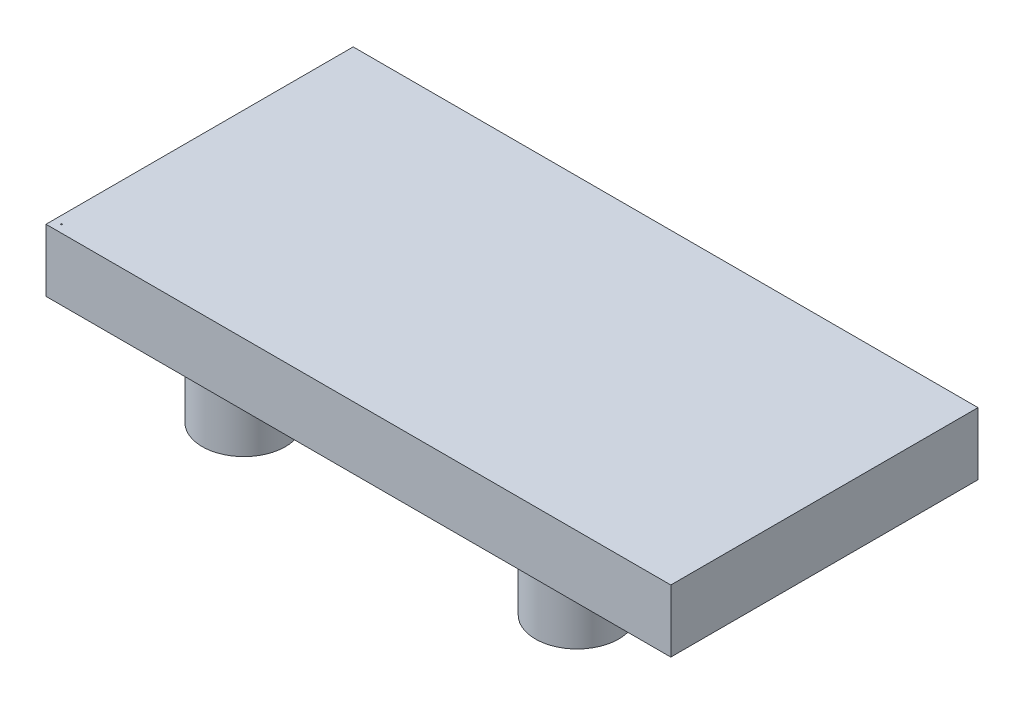
ISO-10303-21;
HEADER;
FILE_DESCRIPTION(('STEP AP214'),'2;1');
FILE_NAME('part.step','',(''),(''),'','','');
FILE_SCHEMA(('AUTOMOTIVE_DESIGN { 1 0 10303 214 1 1 1 1 }'));
ENDSEC;
DATA;
#1=APPLICATION_CONTEXT('core data for automotive mechanical design processes');
#2=APPLICATION_PROTOCOL_DEFINITION('international standard','automotive_design',2000,#1);
#3=PRODUCT_CONTEXT('',#1,'mechanical');
#4=PRODUCT('Part','Part','',(#3));
#5=PRODUCT_RELATED_PRODUCT_CATEGORY('part','',(#4));
#6=PRODUCT_DEFINITION_FORMATION('','',#4);
#7=PRODUCT_DEFINITION_CONTEXT('part definition',#1,'design');
#8=PRODUCT_DEFINITION('design','',#6,#7);
#9=PRODUCT_DEFINITION_SHAPE('','',#8);
#10=(LENGTH_UNIT() NAMED_UNIT(*) SI_UNIT(.MILLI.,.METRE.));
#11=(NAMED_UNIT(*) PLANE_ANGLE_UNIT() SI_UNIT($,.RADIAN.));
#12=(NAMED_UNIT(*) SI_UNIT($,.STERADIAN.) SOLID_ANGLE_UNIT());
#13=UNCERTAINTY_MEASURE_WITH_UNIT(LENGTH_MEASURE(1.E-05),#10,'distance_accuracy_value','');
#14=(GEOMETRIC_REPRESENTATION_CONTEXT(3) GLOBAL_UNCERTAINTY_ASSIGNED_CONTEXT((#13)) GLOBAL_UNIT_ASSIGNED_CONTEXT((#10,
#11,#12)) REPRESENTATION_CONTEXT('',''));
#15=CARTESIAN_POINT('',(0.,0.,0.));
#16=DIRECTION('',(0.,0.,1.));
#17=DIRECTION('',(1.,0.,0.));
#18=AXIS2_PLACEMENT_3D('',#15,#16,#17);
#19=CARTESIAN_POINT('',(0.,-304.8,-1498.6));
#20=DIRECTION('',(0.,-1.,0.));
#21=DIRECTION('',(0.,0.,-1.));
#22=AXIS2_PLACEMENT_3D('',#19,#20,#21);
#23=PLANE('',#22);
#24=CARTESIAN_POINT('',(711.2,-304.8,-1270.));
#25=DIRECTION('',(0.,-1.,0.));
#26=DIRECTION('',(0.,0.,-1.));
#27=AXIS2_PLACEMENT_3D('',#24,#25,#26);
#28=CIRCLE('',#27,203.2);
#29=CARTESIAN_POINT('',(711.2,-304.8,-1473.2));
#30=VERTEX_POINT('',#29);
#31=EDGE_CURVE('E151',#30,#30,#28,.T.);
#32=ORIENTED_EDGE('',*,*,#31,.F.);
#33=EDGE_LOOP('',(#32));
#34=FACE_BOUND('',#33,.T.);
#35=CARTESIAN_POINT('',(711.2,-304.8,-254.));
#36=DIRECTION('',(0.,-1.,0.));
#37=DIRECTION('',(0.,0.,-1.));
#38=AXIS2_PLACEMENT_3D('',#35,#36,#37);
#39=CIRCLE('',#38,203.2);
#40=CARTESIAN_POINT('',(711.2,-304.8,-457.2));
#41=VERTEX_POINT('',#40);
#42=EDGE_CURVE('E163',#41,#41,#39,.T.);
#43=ORIENTED_EDGE('',*,*,#42,.F.);
#44=EDGE_LOOP('',(#43));
#45=FACE_BOUND('',#44,.T.);
#46=DIRECTION('',(0.,0.,1.));
#47=VECTOR('',#46,1.);
#48=CARTESIAN_POINT('',(0.,-304.8,0.));
#49=LINE('',#48,#47);
#50=CARTESIAN_POINT('',(0.,-304.8,-1498.6));
#51=VERTEX_POINT('',#50);
#52=CARTESIAN_POINT('',(0.,-304.8,0.));
#53=VERTEX_POINT('',#52);
#54=EDGE_CURVE('E93',#51,#53,#49,.T.);
#55=ORIENTED_EDGE('',*,*,#54,.F.);
#56=DIRECTION('',(-1.,0.,0.));
#57=VECTOR('',#56,1.);
#58=CARTESIAN_POINT('',(0.,-304.8,-1498.6));
#59=LINE('',#58,#57);
#60=CARTESIAN_POINT('',(3048.,-304.8,-1498.6));
#61=VERTEX_POINT('',#60);
#62=EDGE_CURVE('E90',#61,#51,#59,.T.);
#63=ORIENTED_EDGE('',*,*,#62,.F.);
#64=DIRECTION('',(0.,0.,-1.));
#65=VECTOR('',#64,1.);
#66=CARTESIAN_POINT('',(3048.,-304.8,0.));
#67=LINE('',#66,#65);
#68=CARTESIAN_POINT('',(3048.,-304.8,0.));
#69=VERTEX_POINT('',#68);
#70=EDGE_CURVE('E83',#69,#61,#67,.T.);
#71=ORIENTED_EDGE('',*,*,#70,.F.);
#72=DIRECTION('',(1.,0.,0.));
#73=VECTOR('',#72,1.);
#74=CARTESIAN_POINT('',(0.,-304.8,0.));
#75=LINE('',#74,#73);
#76=EDGE_CURVE('E89',#53,#69,#75,.T.);
#77=ORIENTED_EDGE('',*,*,#76,.F.);
#78=EDGE_LOOP('',(#55,#63,#71,#77));
#79=FACE_BOUND('',#78,.T.);
#80=CARTESIAN_POINT('',(2336.8,-304.8,-254.));
#81=DIRECTION('',(0.,-1.,0.));
#82=DIRECTION('',(0.,0.,-1.));
#83=AXIS2_PLACEMENT_3D('',#80,#81,#82);
#84=CIRCLE('',#83,203.2);
#85=CARTESIAN_POINT('',(2336.8,-304.8,-457.2));
#86=VERTEX_POINT('',#85);
#87=EDGE_CURVE('E157',#86,#86,#84,.T.);
#88=ORIENTED_EDGE('',*,*,#87,.F.);
#89=EDGE_LOOP('',(#88));
#90=FACE_BOUND('',#89,.T.);
#91=CARTESIAN_POINT('',(2336.8,-304.8,-1270.));
#92=DIRECTION('',(0.,-1.,0.));
#93=DIRECTION('',(0.,0.,-1.));
#94=AXIS2_PLACEMENT_3D('',#91,#92,#93);
#95=CIRCLE('',#94,203.2);
#96=CARTESIAN_POINT('',(2336.8,-304.8,-1473.2));
#97=VERTEX_POINT('',#96);
#98=EDGE_CURVE('E145',#97,#97,#95,.T.);
#99=ORIENTED_EDGE('',*,*,#98,.F.);
#100=EDGE_LOOP('',(#99));
#101=FACE_BOUND('',#100,.T.);
#102=ADVANCED_FACE('F34',(#34,#45,#79,#90,#101),#23,.T.);
#103=CARTESIAN_POINT('',(0.,-304.8,0.));
#104=DIRECTION('',(-1.,0.,0.));
#105=DIRECTION('',(0.,0.,1.));
#106=AXIS2_PLACEMENT_3D('',#103,#104,#105);
#107=PLANE('',#106);
#108=DIRECTION('',(0.,0.,1.));
#109=VECTOR('',#108,1.);
#110=CARTESIAN_POINT('',(0.,0.,0.));
#111=LINE('',#110,#109);
#112=CARTESIAN_POINT('',(0.,0.,-1498.6));
#113=VERTEX_POINT('',#112);
#114=CARTESIAN_POINT('',(0.,0.,0.));
#115=VERTEX_POINT('',#114);
#116=EDGE_CURVE('E100',#113,#115,#111,.T.);
#117=ORIENTED_EDGE('',*,*,#116,.F.);
#118=DIRECTION('',(0.,1.,0.));
#119=VECTOR('',#118,1.);
#120=CARTESIAN_POINT('',(0.,-304.8,-1498.6));
#121=LINE('',#120,#119);
#122=EDGE_CURVE('E11',#51,#113,#121,.T.);
#123=ORIENTED_EDGE('',*,*,#122,.F.);
#124=ORIENTED_EDGE('',*,*,#54,.T.);
#125=DIRECTION('',(0.,1.,0.));
#126=VECTOR('',#125,1.);
#127=CARTESIAN_POINT('',(0.,-304.8,0.));
#128=LINE('',#127,#126);
#129=EDGE_CURVE('E38',#53,#115,#128,.T.);
#130=ORIENTED_EDGE('',*,*,#129,.T.);
#131=EDGE_LOOP('',(#117,#123,#124,#130));
#132=FACE_BOUND('',#131,.T.);
#133=ADVANCED_FACE('F36',(#132),#107,.T.);
#134=CARTESIAN_POINT('',(0.,-304.8,-1498.6));
#135=DIRECTION('',(0.,0.,-1.));
#136=DIRECTION('',(-1.,0.,0.));
#137=AXIS2_PLACEMENT_3D('',#134,#135,#136);
#138=PLANE('',#137);
#139=DIRECTION('',(-1.,0.,0.));
#140=VECTOR('',#139,1.);
#141=CARTESIAN_POINT('',(0.,0.,-1498.6));
#142=LINE('',#141,#140);
#143=CARTESIAN_POINT('',(3048.,0.,-1498.6));
#144=VERTEX_POINT('',#143);
#145=EDGE_CURVE('E95',#144,#113,#142,.T.);
#146=ORIENTED_EDGE('',*,*,#145,.F.);
#147=DIRECTION('',(0.,1.,0.));
#148=VECTOR('',#147,1.);
#149=CARTESIAN_POINT('',(3048.,-304.8,-1498.6));
#150=LINE('',#149,#148);
#151=EDGE_CURVE('E44',#61,#144,#150,.T.);
#152=ORIENTED_EDGE('',*,*,#151,.F.);
#153=ORIENTED_EDGE('',*,*,#62,.T.);
#154=ORIENTED_EDGE('',*,*,#122,.T.);
#155=EDGE_LOOP('',(#146,#152,#153,#154));
#156=FACE_BOUND('',#155,.T.);
#157=ADVANCED_FACE('F111',(#156),#138,.T.);
#158=CARTESIAN_POINT('',(3048.,-304.8,0.));
#159=DIRECTION('',(1.,0.,0.));
#160=DIRECTION('',(0.,0.,-1.));
#161=AXIS2_PLACEMENT_3D('',#158,#159,#160);
#162=PLANE('',#161);
#163=DIRECTION('',(0.,0.,-1.));
#164=VECTOR('',#163,1.);
#165=CARTESIAN_POINT('',(3048.,0.,0.));
#166=LINE('',#165,#164);
#167=CARTESIAN_POINT('',(3048.,0.,0.));
#168=VERTEX_POINT('',#167);
#169=EDGE_CURVE('E85',#168,#144,#166,.T.);
#170=ORIENTED_EDGE('',*,*,#169,.F.);
#171=DIRECTION('',(0.,1.,0.));
#172=VECTOR('',#171,1.);
#173=CARTESIAN_POINT('',(3048.,-304.8,0.));
#174=LINE('',#173,#172);
#175=EDGE_CURVE('E80',#69,#168,#174,.T.);
#176=ORIENTED_EDGE('',*,*,#175,.F.);
#177=ORIENTED_EDGE('',*,*,#70,.T.);
#178=ORIENTED_EDGE('',*,*,#151,.T.);
#179=EDGE_LOOP('',(#170,#176,#177,#178));
#180=FACE_BOUND('',#179,.T.);
#181=ADVANCED_FACE('F82',(#180),#162,.T.);
#182=CARTESIAN_POINT('',(0.,-304.8,0.));
#183=DIRECTION('',(0.,0.,1.));
#184=DIRECTION('',(1.,0.,0.));
#185=AXIS2_PLACEMENT_3D('',#182,#183,#184);
#186=PLANE('',#185);
#187=DIRECTION('',(1.,0.,0.));
#188=VECTOR('',#187,1.);
#189=CARTESIAN_POINT('',(0.,0.,0.));
#190=LINE('',#189,#188);
#191=EDGE_CURVE('E103',#115,#168,#190,.T.);
#192=ORIENTED_EDGE('',*,*,#191,.F.);
#193=ORIENTED_EDGE('',*,*,#129,.F.);
#194=ORIENTED_EDGE('',*,*,#76,.T.);
#195=ORIENTED_EDGE('',*,*,#175,.T.);
#196=EDGE_LOOP('',(#192,#193,#194,#195));
#197=FACE_BOUND('',#196,.T.);
#198=ADVANCED_FACE('F92',(#197),#186,.T.);
#199=CARTESIAN_POINT('',(0.,0.,-1498.6));
#200=DIRECTION('',(0.,-1.,0.));
#201=DIRECTION('',(0.,0.,-1.));
#202=AXIS2_PLACEMENT_3D('',#199,#200,#201);
#203=PLANE('',#202);
#204=CARTESIAN_POINT('',(38.1,0.,-38.1));
#205=DIRECTION('',(0.,1.,0.));
#206=DIRECTION('',(0.,0.,1.));
#207=AXIS2_PLACEMENT_3D('',#204,#205,#206);
#208=CIRCLE('',#207,3.17500000000006);
#209=CARTESIAN_POINT('',(38.1,0.,-34.925));
#210=VERTEX_POINT('',#209);
#211=EDGE_CURVE('E140',#210,#210,#208,.T.);
#212=ORIENTED_EDGE('',*,*,#211,.F.);
#213=EDGE_LOOP('',(#212));
#214=FACE_BOUND('',#213,.T.);
#215=ORIENTED_EDGE('',*,*,#116,.T.);
#216=ORIENTED_EDGE('',*,*,#191,.T.);
#217=ORIENTED_EDGE('',*,*,#169,.T.);
#218=ORIENTED_EDGE('',*,*,#145,.T.);
#219=EDGE_LOOP('',(#215,#216,#217,#218));
#220=FACE_BOUND('',#219,.T.);
#221=ADVANCED_FACE('F110',(#214,#220),#203,.F.);
#222=CARTESIAN_POINT('',(711.2,-609.6,-254.));
#223=DIRECTION('',(0.,1.,0.));
#224=DIRECTION('',(0.,0.,1.));
#225=AXIS2_PLACEMENT_3D('',#222,#223,#224);
#226=CYLINDRICAL_SURFACE('',#225,203.2);
#227=CARTESIAN_POINT('',(711.2,-609.6,-254.));
#228=DIRECTION('',(0.,-1.,0.));
#229=DIRECTION('',(0.,0.,-1.));
#230=AXIS2_PLACEMENT_3D('',#227,#228,#229);
#231=CIRCLE('',#230,203.2);
#232=CARTESIAN_POINT('',(711.2,-609.6,-457.2));
#233=VERTEX_POINT('',#232);
#234=EDGE_CURVE('E104',#233,#233,#231,.T.);
#235=ORIENTED_EDGE('',*,*,#234,.F.);
#236=EDGE_LOOP('',(#235));
#237=FACE_BOUND('',#236,.T.);
#238=ORIENTED_EDGE('',*,*,#42,.T.);
#239=EDGE_LOOP('',(#238));
#240=FACE_BOUND('',#239,.T.);
#241=ADVANCED_FACE('F128',(#237,#240),#226,.T.);
#242=CARTESIAN_POINT('',(711.2,-609.6,-254.));
#243=DIRECTION('',(0.,-1.,0.));
#244=DIRECTION('',(0.,0.,-1.));
#245=AXIS2_PLACEMENT_3D('',#242,#243,#244);
#246=PLANE('',#245);
#247=ORIENTED_EDGE('',*,*,#234,.T.);
#248=EDGE_LOOP('',(#247));
#249=FACE_BOUND('',#248,.T.);
#250=ADVANCED_FACE('F136',(#249),#246,.T.);
#251=CARTESIAN_POINT('',(2336.8,-609.6,-254.));
#252=DIRECTION('',(0.,1.,0.));
#253=DIRECTION('',(0.,0.,1.));
#254=AXIS2_PLACEMENT_3D('',#251,#252,#253);
#255=CYLINDRICAL_SURFACE('',#254,203.2);
#256=CARTESIAN_POINT('',(2336.8,-609.6,-254.));
#257=DIRECTION('',(0.,-1.,0.));
#258=DIRECTION('',(0.,0.,-1.));
#259=AXIS2_PLACEMENT_3D('',#256,#257,#258);
#260=CIRCLE('',#259,203.2);
#261=CARTESIAN_POINT('',(2336.8,-609.6,-457.2));
#262=VERTEX_POINT('',#261);
#263=EDGE_CURVE('E160',#262,#262,#260,.T.);
#264=ORIENTED_EDGE('',*,*,#263,.F.);
#265=EDGE_LOOP('',(#264));
#266=FACE_BOUND('',#265,.T.);
#267=ORIENTED_EDGE('',*,*,#87,.T.);
#268=EDGE_LOOP('',(#267));
#269=FACE_BOUND('',#268,.T.);
#270=ADVANCED_FACE('F173',(#266,#269),#255,.T.);
#271=CARTESIAN_POINT('',(2336.8,-609.6,-254.));
#272=DIRECTION('',(0.,-1.,0.));
#273=DIRECTION('',(0.,0.,-1.));
#274=AXIS2_PLACEMENT_3D('',#271,#272,#273);
#275=PLANE('',#274);
#276=ORIENTED_EDGE('',*,*,#263,.T.);
#277=EDGE_LOOP('',(#276));
#278=FACE_BOUND('',#277,.T.);
#279=ADVANCED_FACE('F177',(#278),#275,.T.);
#280=CARTESIAN_POINT('',(711.2,-609.6,-1270.));
#281=DIRECTION('',(0.,1.,0.));
#282=DIRECTION('',(0.,0.,1.));
#283=AXIS2_PLACEMENT_3D('',#280,#281,#282);
#284=CYLINDRICAL_SURFACE('',#283,203.2);
#285=CARTESIAN_POINT('',(711.2,-609.6,-1270.));
#286=DIRECTION('',(0.,-1.,0.));
#287=DIRECTION('',(0.,0.,-1.));
#288=AXIS2_PLACEMENT_3D('',#285,#286,#287);
#289=CIRCLE('',#288,203.2);
#290=CARTESIAN_POINT('',(711.2,-609.6,-1473.2));
#291=VERTEX_POINT('',#290);
#292=EDGE_CURVE('E154',#291,#291,#289,.T.);
#293=ORIENTED_EDGE('',*,*,#292,.F.);
#294=EDGE_LOOP('',(#293));
#295=FACE_BOUND('',#294,.T.);
#296=ORIENTED_EDGE('',*,*,#31,.T.);
#297=EDGE_LOOP('',(#296));
#298=FACE_BOUND('',#297,.T.);
#299=ADVANCED_FACE('F183',(#295,#298),#284,.T.);
#300=CARTESIAN_POINT('',(711.2,-609.6,-1270.));
#301=DIRECTION('',(0.,-1.,0.));
#302=DIRECTION('',(0.,0.,-1.));
#303=AXIS2_PLACEMENT_3D('',#300,#301,#302);
#304=PLANE('',#303);
#305=ORIENTED_EDGE('',*,*,#292,.T.);
#306=EDGE_LOOP('',(#305));
#307=FACE_BOUND('',#306,.T.);
#308=ADVANCED_FACE('F187',(#307),#304,.T.);
#309=CARTESIAN_POINT('',(2336.8,-609.6,-1270.));
#310=DIRECTION('',(0.,1.,0.));
#311=DIRECTION('',(0.,0.,1.));
#312=AXIS2_PLACEMENT_3D('',#309,#310,#311);
#313=CYLINDRICAL_SURFACE('',#312,203.2);
#314=CARTESIAN_POINT('',(2336.8,-609.6,-1270.));
#315=DIRECTION('',(0.,-1.,0.));
#316=DIRECTION('',(0.,0.,-1.));
#317=AXIS2_PLACEMENT_3D('',#314,#315,#316);
#318=CIRCLE('',#317,203.2);
#319=CARTESIAN_POINT('',(2336.8,-609.6,-1473.2));
#320=VERTEX_POINT('',#319);
#321=EDGE_CURVE('E148',#320,#320,#318,.T.);
#322=ORIENTED_EDGE('',*,*,#321,.F.);
#323=EDGE_LOOP('',(#322));
#324=FACE_BOUND('',#323,.T.);
#325=ORIENTED_EDGE('',*,*,#98,.T.);
#326=EDGE_LOOP('',(#325));
#327=FACE_BOUND('',#326,.T.);
#328=ADVANCED_FACE('F191',(#324,#327),#313,.T.);
#329=CARTESIAN_POINT('',(2336.8,-609.6,-1270.));
#330=DIRECTION('',(0.,-1.,0.));
#331=DIRECTION('',(0.,0.,-1.));
#332=AXIS2_PLACEMENT_3D('',#329,#330,#331);
#333=PLANE('',#332);
#334=ORIENTED_EDGE('',*,*,#321,.T.);
#335=EDGE_LOOP('',(#334));
#336=FACE_BOUND('',#335,.T.);
#337=ADVANCED_FACE('F195',(#336),#333,.T.);
#338=CARTESIAN_POINT('',(38.1,-25.4,-38.1));
#339=DIRECTION('',(0.,1.,0.));
#340=DIRECTION('',(0.,0.,1.));
#341=AXIS2_PLACEMENT_3D('',#338,#339,#340);
#342=CYLINDRICAL_SURFACE('',#341,3.17500000000006);
#343=CARTESIAN_POINT('',(38.1,-25.4,-38.1));
#344=DIRECTION('',(0.,1.,0.));
#345=DIRECTION('',(0.,0.,1.));
#346=AXIS2_PLACEMENT_3D('',#343,#344,#345);
#347=CIRCLE('',#346,3.17500000000006);
#348=CARTESIAN_POINT('',(38.1,-25.4,-34.925));
#349=VERTEX_POINT('',#348);
#350=EDGE_CURVE('E142',#349,#349,#347,.T.);
#351=ORIENTED_EDGE('',*,*,#350,.F.);
#352=EDGE_LOOP('',(#351));
#353=FACE_BOUND('',#352,.T.);
#354=ORIENTED_EDGE('',*,*,#211,.T.);
#355=EDGE_LOOP('',(#354));
#356=FACE_BOUND('',#355,.T.);
#357=ADVANCED_FACE('F199',(#353,#356),#342,.F.);
#358=CARTESIAN_POINT('',(38.1,-25.4,-38.1));
#359=DIRECTION('',(0.,1.,0.));
#360=DIRECTION('',(0.,0.,1.));
#361=AXIS2_PLACEMENT_3D('',#358,#359,#360);
#362=PLANE('',#361);
#363=ORIENTED_EDGE('',*,*,#350,.T.);
#364=EDGE_LOOP('',(#363));
#365=FACE_BOUND('',#364,.T.);
#366=ADVANCED_FACE('F203',(#365),#362,.T.);
#367=CLOSED_SHELL('',(#102,#133,#157,#181,#198,#221,#241,#250,#270,#279,#299,#308,#328,#337,
#357,#366));
#368=MANIFOLD_SOLID_BREP('B2',#367);
#369=ADVANCED_BREP_SHAPE_REPRESENTATION('',(#18,#368),#14);
#370=SHAPE_DEFINITION_REPRESENTATION(#9,#369);
ENDSEC;
END-ISO-10303-21;
